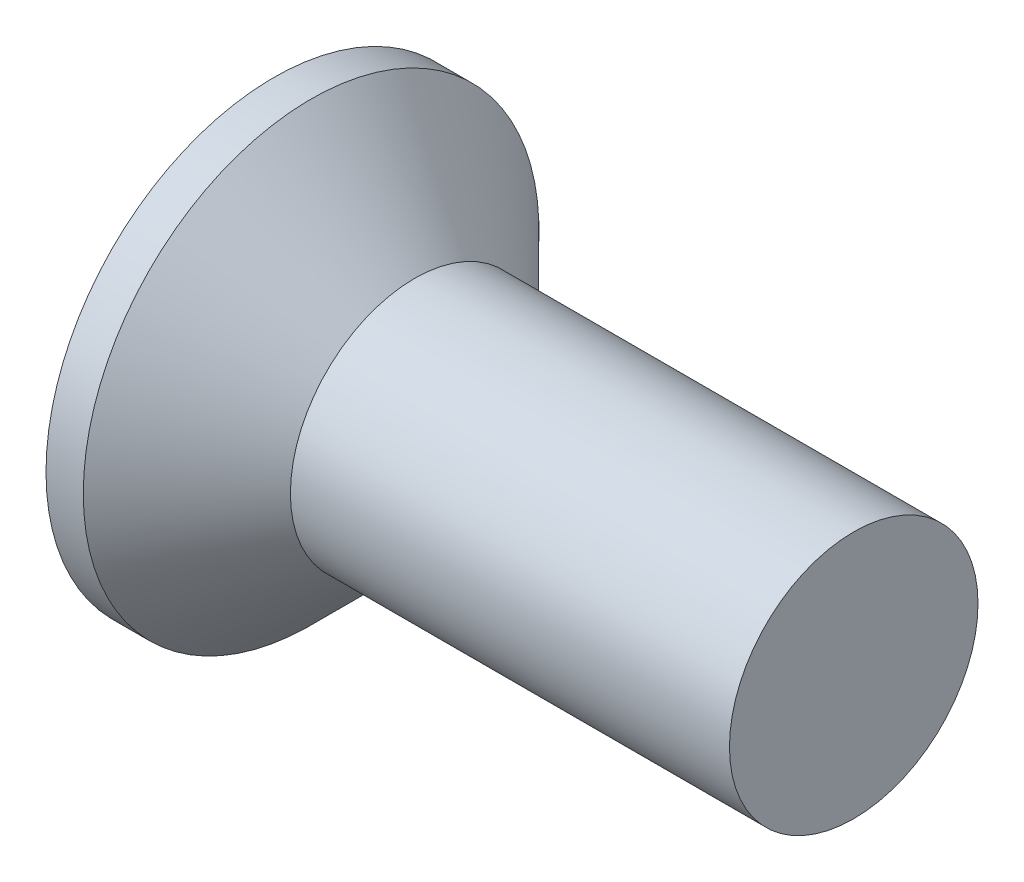
ISO-10303-21;
HEADER;
FILE_DESCRIPTION(('STEP AP214'),'2;1');
FILE_NAME('part.step','',(''),(''),'','','');
FILE_SCHEMA(('AUTOMOTIVE_DESIGN { 1 0 10303 214 1 1 1 1 }'));
ENDSEC;
DATA;
#1=APPLICATION_CONTEXT('core data for automotive mechanical design processes');
#2=APPLICATION_PROTOCOL_DEFINITION('international standard','automotive_design',2000,#1);
#3=PRODUCT_CONTEXT('',#1,'mechanical');
#4=PRODUCT('Part','Part','',(#3));
#5=PRODUCT_RELATED_PRODUCT_CATEGORY('part','',(#4));
#6=PRODUCT_DEFINITION_FORMATION('','',#4);
#7=PRODUCT_DEFINITION_CONTEXT('part definition',#1,'design');
#8=PRODUCT_DEFINITION('design','',#6,#7);
#9=PRODUCT_DEFINITION_SHAPE('','',#8);
#10=(LENGTH_UNIT() NAMED_UNIT(*) SI_UNIT(.MILLI.,.METRE.));
#11=(NAMED_UNIT(*) PLANE_ANGLE_UNIT() SI_UNIT($,.RADIAN.));
#12=(NAMED_UNIT(*) SI_UNIT($,.STERADIAN.) SOLID_ANGLE_UNIT());
#13=UNCERTAINTY_MEASURE_WITH_UNIT(LENGTH_MEASURE(1.E-05),#10,'distance_accuracy_value','');
#14=(GEOMETRIC_REPRESENTATION_CONTEXT(3) GLOBAL_UNCERTAINTY_ASSIGNED_CONTEXT((#13)) GLOBAL_UNIT_ASSIGNED_CONTEXT((#10,
#11,#12)) REPRESENTATION_CONTEXT('',''));
#15=CARTESIAN_POINT('',(0.,0.,0.));
#16=DIRECTION('',(0.,0.,1.));
#17=DIRECTION('',(1.,0.,0.));
#18=AXIS2_PLACEMENT_3D('',#15,#16,#17);
#19=CARTESIAN_POINT('',(0.,0.,0.));
#20=DIRECTION('',(-1.,0.,0.));
#21=DIRECTION('',(0.,0.,1.));
#22=AXIS2_PLACEMENT_3D('',#19,#20,#21);
#23=PLANE('',#22);
#24=CARTESIAN_POINT('',(0.,0.,0.));
#25=DIRECTION('',(-1.,0.,0.));
#26=DIRECTION('',(0.,0.,1.));
#27=AXIS2_PLACEMENT_3D('',#24,#25,#26);
#28=CIRCLE('',#27,2.75);
#29=CARTESIAN_POINT('',(0.,0.,2.75));
#30=VERTEX_POINT('',#29);
#31=EDGE_CURVE('E46',#30,#30,#28,.T.);
#32=ORIENTED_EDGE('',*,*,#31,.T.);
#33=EDGE_LOOP('',(#32));
#34=FACE_BOUND('',#33,.T.);
#35=DIRECTION('',(0.,1.,0.));
#36=VECTOR('',#35,1.);
#37=CARTESIAN_POINT('',(0.,-1.55,-0.395));
#38=LINE('',#37,#36);
#39=CARTESIAN_POINT('',(0.,-1.55,-0.395));
#40=VERTEX_POINT('',#39);
#41=CARTESIAN_POINT('',(0.,-0.394999999999999,-0.395));
#42=VERTEX_POINT('',#41);
#43=EDGE_CURVE('E107',#40,#42,#38,.T.);
#44=ORIENTED_EDGE('',*,*,#43,.T.);
#45=DIRECTION('',(0.,0.,-1.));
#46=VECTOR('',#45,1.);
#47=CARTESIAN_POINT('',(0.,-0.395000000000005,1.55));
#48=LINE('',#47,#46);
#49=CARTESIAN_POINT('',(0.,-0.394999999999994,-1.55));
#50=VERTEX_POINT('',#49);
#51=EDGE_CURVE('E87',#42,#50,#48,.T.);
#52=ORIENTED_EDGE('',*,*,#51,.T.);
#53=DIRECTION('',(0.,1.,0.));
#54=VECTOR('',#53,1.);
#55=CARTESIAN_POINT('',(0.,-0.394999999999994,-1.55));
#56=LINE('',#55,#54);
#57=CARTESIAN_POINT('',(0.,0.395000000000005,-1.55));
#58=VERTEX_POINT('',#57);
#59=EDGE_CURVE('E344',#50,#58,#56,.T.);
#60=ORIENTED_EDGE('',*,*,#59,.T.);
#61=DIRECTION('',(0.,0.,1.));
#62=VECTOR('',#61,1.);
#63=CARTESIAN_POINT('',(0.,0.395000000000005,-1.55));
#64=LINE('',#63,#62);
#65=CARTESIAN_POINT('',(0.,0.395000000000001,-0.395));
#66=VERTEX_POINT('',#65);
#67=EDGE_CURVE('E103',#58,#66,#64,.T.);
#68=ORIENTED_EDGE('',*,*,#67,.T.);
#69=CARTESIAN_POINT('',(0.,1.55,-0.395));
#70=VERTEX_POINT('',#69);
#71=EDGE_CURVE('E97',#66,#70,#38,.T.);
#72=ORIENTED_EDGE('',*,*,#71,.T.);
#73=DIRECTION('',(0.,0.,1.));
#74=VECTOR('',#73,1.);
#75=CARTESIAN_POINT('',(0.,1.55,-0.395));
#76=LINE('',#75,#74);
#77=CARTESIAN_POINT('',(0.,1.55,0.395));
#78=VERTEX_POINT('',#77);
#79=EDGE_CURVE('E100',#70,#78,#76,.T.);
#80=ORIENTED_EDGE('',*,*,#79,.T.);
#81=DIRECTION('',(0.,-1.,0.));
#82=VECTOR('',#81,1.);
#83=CARTESIAN_POINT('',(0.,1.55,0.395));
#84=LINE('',#83,#82);
#85=CARTESIAN_POINT('',(0.,0.394999999999998,0.395));
#86=VERTEX_POINT('',#85);
#87=EDGE_CURVE('E356',#78,#86,#84,.T.);
#88=ORIENTED_EDGE('',*,*,#87,.T.);
#89=CARTESIAN_POINT('',(0.,0.394999999999994,1.55));
#90=VERTEX_POINT('',#89);
#91=EDGE_CURVE('E339',#86,#90,#64,.T.);
#92=ORIENTED_EDGE('',*,*,#91,.T.);
#93=DIRECTION('',(0.,-1.,0.));
#94=VECTOR('',#93,1.);
#95=CARTESIAN_POINT('',(0.,0.394999999999994,1.55));
#96=LINE('',#95,#94);
#97=CARTESIAN_POINT('',(0.,-0.395000000000005,1.55));
#98=VERTEX_POINT('',#97);
#99=EDGE_CURVE('E325',#90,#98,#96,.T.);
#100=ORIENTED_EDGE('',*,*,#99,.T.);
#101=CARTESIAN_POINT('',(0.,-0.395000000000001,0.395));
#102=VERTEX_POINT('',#101);
#103=EDGE_CURVE('E337',#98,#102,#48,.T.);
#104=ORIENTED_EDGE('',*,*,#103,.T.);
#105=CARTESIAN_POINT('',(0.,-1.55,0.395));
#106=VERTEX_POINT('',#105);
#107=EDGE_CURVE('E113',#102,#106,#84,.T.);
#108=ORIENTED_EDGE('',*,*,#107,.T.);
#109=DIRECTION('',(0.,0.,-1.));
#110=VECTOR('',#109,1.);
#111=CARTESIAN_POINT('',(0.,-1.55,0.395));
#112=LINE('',#111,#110);
#113=EDGE_CURVE('E136',#106,#40,#112,.T.);
#114=ORIENTED_EDGE('',*,*,#113,.T.);
#115=EDGE_LOOP('',(#44,#52,#60,#68,#72,#80,#88,#92,#100,#104,#108,#114));
#116=FACE_BOUND('',#115,.T.);
#117=ADVANCED_FACE('F39',(#34,#116),#23,.T.);
#118=CARTESIAN_POINT('',(2.38373382624769,0.,0.168659889094269));
#119=DIRECTION('',(-0.0945267588569114,0.,-0.995522321125954));
#120=DIRECTION('',(-0.995522321125954,0.,0.0945267588569114));
#121=AXIS2_PLACEMENT_3D('',#118,#119,#120);
#122=PLANE('',#121);
#123=ORIENTED_EDGE('',*,*,#107,.F.);
#124=DIRECTION('',(0.991104257398676,0.0941072552097303,-0.09410725520973));
#125=VECTOR('',#124,1.);
#126=CARTESIAN_POINT('',(2.39946475118715,-0.167166207519493,0.167166207519491));
#127=LINE('',#126,#125);
#128=CARTESIAN_POINT('',(2.08,-0.197500000000003,0.1975));
#129=VERTEX_POINT('',#128);
#130=EDGE_CURVE('E131',#102,#129,#127,.T.);
#131=ORIENTED_EDGE('',*,*,#130,.T.);
#132=DIRECTION('',(0.835707904588478,0.543411029305728,-0.0793520726712617));
#133=VECTOR('',#132,1.);
#134=CARTESIAN_POINT('',(0.,-1.55,0.395));
#135=LINE('',#134,#133);
#136=EDGE_CURVE('E108',#106,#129,#135,.T.);
#137=ORIENTED_EDGE('',*,*,#136,.F.);
#138=EDGE_LOOP('',(#123,#131,#137));
#139=FACE_BOUND('',#138,.T.);
#140=ADVANCED_FACE('F159',(#139),#122,.T.);
#141=DIRECTION('',(0.835707904588477,-0.543411029305729,-0.0793520726712615));
#142=VECTOR('',#141,1.);
#143=CARTESIAN_POINT('',(0.,1.55,0.395));
#144=LINE('',#143,#142);
#145=CARTESIAN_POINT('',(2.08,0.197499999999997,0.1975));
#146=VERTEX_POINT('',#145);
#147=EDGE_CURVE('E53',#78,#146,#144,.T.);
#148=ORIENTED_EDGE('',*,*,#147,.T.);
#149=DIRECTION('',(-0.991104257398676,0.0941072552097295,0.0941072552097299));
#150=VECTOR('',#149,1.);
#151=CARTESIAN_POINT('',(2.39946475118715,0.167166207519486,0.167166207519491));
#152=LINE('',#151,#150);
#153=EDGE_CURVE('E352',#146,#86,#152,.T.);
#154=ORIENTED_EDGE('',*,*,#153,.T.);
#155=ORIENTED_EDGE('',*,*,#87,.F.);
#156=EDGE_LOOP('',(#148,#154,#155));
#157=FACE_BOUND('',#156,.T.);
#158=ADVANCED_FACE('F163',(#157),#122,.T.);
#159=CARTESIAN_POINT('',(2.38373382624769,0.,-0.168659889094269));
#160=DIRECTION('',(-0.0945267588569113,0.,0.995522321125954));
#161=DIRECTION('',(0.995522321125954,0.,0.0945267588569113));
#162=AXIS2_PLACEMENT_3D('',#159,#160,#161);
#163=PLANE('',#162);
#164=DIRECTION('',(0.835707904588478,0.543411029305728,0.0793520726712615));
#165=VECTOR('',#164,1.);
#166=CARTESIAN_POINT('',(0.,-1.55,-0.395));
#167=LINE('',#166,#165);
#168=CARTESIAN_POINT('',(2.08,-0.197500000000002,-0.1975));
#169=VERTEX_POINT('',#168);
#170=EDGE_CURVE('E62',#40,#169,#167,.T.);
#171=ORIENTED_EDGE('',*,*,#170,.T.);
#172=DIRECTION('',(-0.991104257398676,-0.0941072552097296,-0.0941072552097298));
#173=VECTOR('',#172,1.);
#174=CARTESIAN_POINT('',(2.39946475118715,-0.167166207519491,-0.167166207519488));
#175=LINE('',#174,#173);
#176=EDGE_CURVE('E11',#169,#42,#175,.T.);
#177=ORIENTED_EDGE('',*,*,#176,.T.);
#178=ORIENTED_EDGE('',*,*,#43,.F.);
#179=EDGE_LOOP('',(#171,#177,#178));
#180=FACE_BOUND('',#179,.T.);
#181=ADVANCED_FACE('F156',(#180),#163,.T.);
#182=ORIENTED_EDGE('',*,*,#71,.F.);
#183=DIRECTION('',(0.991104257398676,-0.0941072552097302,0.0941072552097298));
#184=VECTOR('',#183,1.);
#185=CARTESIAN_POINT('',(2.39946475118715,0.167166207519488,-0.167166207519488));
#186=LINE('',#185,#184);
#187=CARTESIAN_POINT('',(2.08,0.197499999999997,-0.1975));
#188=VERTEX_POINT('',#187);
#189=EDGE_CURVE('E116',#66,#188,#186,.T.);
#190=ORIENTED_EDGE('',*,*,#189,.T.);
#191=DIRECTION('',(0.835707904588477,-0.543411029305729,0.0793520726712615));
#192=VECTOR('',#191,1.);
#193=CARTESIAN_POINT('',(0.,1.55,-0.395));
#194=LINE('',#193,#192);
#195=EDGE_CURVE('E112',#70,#188,#194,.T.);
#196=ORIENTED_EDGE('',*,*,#195,.F.);
#197=EDGE_LOOP('',(#182,#190,#196));
#198=FACE_BOUND('',#197,.T.);
#199=ADVANCED_FACE('F115',(#198),#163,.T.);
#200=CARTESIAN_POINT('',(-6.34999999999999,0.,0.));
#201=DIRECTION('',(-1.,0.,0.));
#202=DIRECTION('',(0.,0.,1.));
#203=AXIS2_PLACEMENT_3D('',#200,#201,#202);
#204=CYLINDRICAL_SURFACE('',#203,2.75);
#205=CARTESIAN_POINT('',(0.450000000000005,0.,0.));
#206=DIRECTION('',(-1.,0.,0.));
#207=DIRECTION('',(0.,0.,1.));
#208=AXIS2_PLACEMENT_3D('',#205,#206,#207);
#209=CIRCLE('',#208,2.75);
#210=CARTESIAN_POINT('',(0.450000000000005,0.,2.75));
#211=VERTEX_POINT('',#210);
#212=EDGE_CURVE('E139',#211,#211,#209,.T.);
#213=ORIENTED_EDGE('',*,*,#212,.T.);
#214=EDGE_LOOP('',(#213));
#215=FACE_BOUND('',#214,.T.);
#216=ORIENTED_EDGE('',*,*,#31,.F.);
#217=EDGE_LOOP('',(#216));
#218=FACE_BOUND('',#217,.T.);
#219=ADVANCED_FACE('F145',(#215,#218),#204,.T.);
#220=CARTESIAN_POINT('',(0.450000000000005,0.,0.));
#221=DIRECTION('',(-1.,0.,0.));
#222=DIRECTION('',(0.,0.,1.));
#223=AXIS2_PLACEMENT_3D('',#220,#221,#222);
#224=CONICAL_SURFACE('',#223,2.75,0.78539816339745);
#225=CARTESIAN_POINT('',(1.7,0.,0.));
#226=DIRECTION('',(-1.,0.,0.));
#227=DIRECTION('',(0.,0.,1.));
#228=AXIS2_PLACEMENT_3D('',#225,#226,#227);
#229=CIRCLE('',#228,1.5);
#230=CARTESIAN_POINT('',(1.7,0.,1.5));
#231=VERTEX_POINT('',#230);
#232=EDGE_CURVE('E135',#231,#231,#229,.T.);
#233=ORIENTED_EDGE('',*,*,#232,.T.);
#234=EDGE_LOOP('',(#233));
#235=FACE_BOUND('',#234,.T.);
#236=ORIENTED_EDGE('',*,*,#212,.F.);
#237=EDGE_LOOP('',(#236));
#238=FACE_BOUND('',#237,.T.);
#239=ADVANCED_FACE('F147',(#235,#238),#224,.T.);
#240=CARTESIAN_POINT('',(-6.34999999999999,0.,0.));
#241=DIRECTION('',(-1.,0.,0.));
#242=DIRECTION('',(0.,0.,1.));
#243=AXIS2_PLACEMENT_3D('',#240,#241,#242);
#244=CYLINDRICAL_SURFACE('',#243,1.5);
#245=CARTESIAN_POINT('',(7.,0.,0.));
#246=DIRECTION('',(-1.,0.,0.));
#247=DIRECTION('',(0.,0.,1.));
#248=AXIS2_PLACEMENT_3D('',#245,#246,#247);
#249=CIRCLE('',#248,1.5);
#250=CARTESIAN_POINT('',(7.,0.,1.5));
#251=VERTEX_POINT('',#250);
#252=EDGE_CURVE('E132',#251,#251,#249,.T.);
#253=ORIENTED_EDGE('',*,*,#252,.T.);
#254=EDGE_LOOP('',(#253));
#255=FACE_BOUND('',#254,.T.);
#256=ORIENTED_EDGE('',*,*,#232,.F.);
#257=EDGE_LOOP('',(#256));
#258=FACE_BOUND('',#257,.T.);
#259=ADVANCED_FACE('F153',(#255,#258),#244,.T.);
#260=CARTESIAN_POINT('',(7.,1.5,0.));
#261=DIRECTION('',(1.,0.,0.));
#262=DIRECTION('',(0.,0.,-1.));
#263=AXIS2_PLACEMENT_3D('',#260,#261,#262);
#264=PLANE('',#263);
#265=ORIENTED_EDGE('',*,*,#252,.F.);
#266=EDGE_LOOP('',(#265));
#267=FACE_BOUND('',#266,.T.);
#268=ADVANCED_FACE('F183',(#267),#264,.T.);
#269=CARTESIAN_POINT('',(2.08,0.197499999999997,-0.1975));
#270=DIRECTION('',(1.,0.,0.));
#271=DIRECTION('',(0.,0.,-1.));
#272=AXIS2_PLACEMENT_3D('',#269,#270,#271);
#273=PLANE('',#272);
#274=DIRECTION('',(0.,1.,0.));
#275=VECTOR('',#274,1.);
#276=CARTESIAN_POINT('',(2.08,-0.197500000000002,-0.1975));
#277=LINE('',#276,#275);
#278=EDGE_CURVE('E127',#169,#188,#277,.T.);
#279=ORIENTED_EDGE('',*,*,#278,.F.);
#280=DIRECTION('',(0.,0.,-1.));
#281=VECTOR('',#280,1.);
#282=CARTESIAN_POINT('',(2.08,-0.197500000000002,0.1975));
#283=LINE('',#282,#281);
#284=EDGE_CURVE('E118',#129,#169,#283,.T.);
#285=ORIENTED_EDGE('',*,*,#284,.F.);
#286=DIRECTION('',(0.,-1.,0.));
#287=VECTOR('',#286,1.);
#288=CARTESIAN_POINT('',(2.08,0.197499999999997,0.1975));
#289=LINE('',#288,#287);
#290=EDGE_CURVE('E121',#146,#129,#289,.T.);
#291=ORIENTED_EDGE('',*,*,#290,.F.);
#292=DIRECTION('',(0.,0.,1.));
#293=VECTOR('',#292,1.);
#294=CARTESIAN_POINT('',(2.08,0.197499999999997,-0.1975));
#295=LINE('',#294,#293);
#296=EDGE_CURVE('E125',#188,#146,#295,.T.);
#297=ORIENTED_EDGE('',*,*,#296,.F.);
#298=EDGE_LOOP('',(#279,#285,#291,#297));
#299=FACE_BOUND('',#298,.T.);
#300=ADVANCED_FACE('F180',(#299),#273,.F.);
#301=CARTESIAN_POINT('',(0.,-1.55,-0.395));
#302=DIRECTION('',(-0.54513001368185,0.838351518268576,0.));
#303=DIRECTION('',(-0.838351518268576,-0.54513001368185,0.));
#304=AXIS2_PLACEMENT_3D('',#301,#302,#303);
#305=PLANE('',#304);
#306=ORIENTED_EDGE('',*,*,#170,.F.);
#307=ORIENTED_EDGE('',*,*,#113,.F.);
#308=ORIENTED_EDGE('',*,*,#136,.T.);
#309=ORIENTED_EDGE('',*,*,#284,.T.);
#310=EDGE_LOOP('',(#306,#307,#308,#309));
#311=FACE_BOUND('',#310,.T.);
#312=ADVANCED_FACE('F172',(#311),#305,.T.);
#313=CARTESIAN_POINT('',(2.08,0.197499999999997,0.1975));
#314=DIRECTION('',(-0.54513001368185,-0.838351518268575,0.));
#315=DIRECTION('',(0.838351518268576,-0.54513001368185,0.));
#316=AXIS2_PLACEMENT_3D('',#313,#314,#315);
#317=PLANE('',#316);
#318=ORIENTED_EDGE('',*,*,#147,.F.);
#319=ORIENTED_EDGE('',*,*,#79,.F.);
#320=ORIENTED_EDGE('',*,*,#195,.T.);
#321=ORIENTED_EDGE('',*,*,#296,.T.);
#322=EDGE_LOOP('',(#318,#319,#320,#321));
#323=FACE_BOUND('',#322,.T.);
#324=ADVANCED_FACE('F111',(#323),#317,.T.);
#325=CARTESIAN_POINT('',(2.38373382624769,-0.168659889094273,0.));
#326=DIRECTION('',(-0.0945267588569114,0.995522321125954,0.));
#327=DIRECTION('',(-0.995522321125954,-0.0945267588569114,0.));
#328=AXIS2_PLACEMENT_3D('',#325,#326,#327);
#329=PLANE('',#328);
#330=DIRECTION('',(0.835707904588478,0.0793520726712598,0.543411029305728));
#331=VECTOR('',#330,1.);
#332=CARTESIAN_POINT('',(0.,-0.394999999999994,-1.55));
#333=LINE('',#332,#331);
#334=EDGE_CURVE('E346',#50,#169,#333,.T.);
#335=ORIENTED_EDGE('',*,*,#334,.F.);
#336=ORIENTED_EDGE('',*,*,#51,.F.);
#337=ORIENTED_EDGE('',*,*,#176,.F.);
#338=EDGE_LOOP('',(#335,#336,#337));
#339=FACE_BOUND('',#338,.T.);
#340=ADVANCED_FACE('F179',(#339),#329,.T.);
#341=CARTESIAN_POINT('',(2.38373382624769,0.168659889094268,0.));
#342=DIRECTION('',(-0.0945267588569113,-0.995522321125954,0.));
#343=DIRECTION('',(0.995522321125954,-0.0945267588569113,0.));
#344=AXIS2_PLACEMENT_3D('',#341,#342,#343);
#345=PLANE('',#344);
#346=ORIENTED_EDGE('',*,*,#67,.F.);
#347=DIRECTION('',(0.835707904588478,-0.0793520726712634,0.543411029305728));
#348=VECTOR('',#347,1.);
#349=CARTESIAN_POINT('',(0.,0.395000000000005,-1.55));
#350=LINE('',#349,#348);
#351=EDGE_CURVE('E78',#58,#188,#350,.T.);
#352=ORIENTED_EDGE('',*,*,#351,.T.);
#353=ORIENTED_EDGE('',*,*,#189,.F.);
#354=EDGE_LOOP('',(#346,#352,#353));
#355=FACE_BOUND('',#354,.T.);
#356=ADVANCED_FACE('F222',(#355),#345,.T.);
#357=CARTESIAN_POINT('',(0.,0.395000000000005,-1.55));
#358=DIRECTION('',(-0.54513001368185,0.,0.838351518268576));
#359=DIRECTION('',(-0.838351518268576,0.,-0.54513001368185));
#360=AXIS2_PLACEMENT_3D('',#357,#358,#359);
#361=PLANE('',#360);
#362=ORIENTED_EDGE('',*,*,#351,.F.);
#363=ORIENTED_EDGE('',*,*,#59,.F.);
#364=ORIENTED_EDGE('',*,*,#334,.T.);
#365=ORIENTED_EDGE('',*,*,#278,.T.);
#366=EDGE_LOOP('',(#362,#363,#364,#365));
#367=FACE_BOUND('',#366,.T.);
#368=ADVANCED_FACE('F230',(#367),#361,.T.);
#369=ORIENTED_EDGE('',*,*,#103,.F.);
#370=DIRECTION('',(0.835707904588477,0.0793520726712634,-0.543411029305728));
#371=VECTOR('',#370,1.);
#372=CARTESIAN_POINT('',(0.,-0.395000000000005,1.55));
#373=LINE('',#372,#371);
#374=EDGE_CURVE('E322',#98,#129,#373,.T.);
#375=ORIENTED_EDGE('',*,*,#374,.T.);
#376=ORIENTED_EDGE('',*,*,#130,.F.);
#377=EDGE_LOOP('',(#369,#375,#376));
#378=FACE_BOUND('',#377,.T.);
#379=ADVANCED_FACE('F224',(#378),#329,.T.);
#380=DIRECTION('',(0.835707904588477,-0.0793520726712596,-0.543411029305729));
#381=VECTOR('',#380,1.);
#382=CARTESIAN_POINT('',(0.,0.394999999999994,1.55));
#383=LINE('',#382,#381);
#384=EDGE_CURVE('E333',#90,#146,#383,.T.);
#385=ORIENTED_EDGE('',*,*,#384,.F.);
#386=ORIENTED_EDGE('',*,*,#91,.F.);
#387=ORIENTED_EDGE('',*,*,#153,.F.);
#388=EDGE_LOOP('',(#385,#386,#387));
#389=FACE_BOUND('',#388,.T.);
#390=ADVANCED_FACE('F232',(#389),#345,.T.);
#391=CARTESIAN_POINT('',(2.08,-0.197500000000003,0.1975));
#392=DIRECTION('',(-0.54513001368185,0.,-0.838351518268575));
#393=DIRECTION('',(0.838351518268576,0.,-0.54513001368185));
#394=AXIS2_PLACEMENT_3D('',#391,#392,#393);
#395=PLANE('',#394);
#396=ORIENTED_EDGE('',*,*,#374,.F.);
#397=ORIENTED_EDGE('',*,*,#99,.F.);
#398=ORIENTED_EDGE('',*,*,#384,.T.);
#399=ORIENTED_EDGE('',*,*,#290,.T.);
#400=EDGE_LOOP('',(#396,#397,#398,#399));
#401=FACE_BOUND('',#400,.T.);
#402=ADVANCED_FACE('F251',(#401),#395,.T.);
#403=CLOSED_SHELL('',(#117,#140,#158,#181,#199,#219,#239,#259,#268,#300,#312,#324,#340,#356,
#368,#379,#390,#402));
#404=MANIFOLD_SOLID_BREP('B2',#403);
#405=ADVANCED_BREP_SHAPE_REPRESENTATION('',(#18,#404),#14);
#406=SHAPE_DEFINITION_REPRESENTATION(#9,#405);
ENDSEC;
END-ISO-10303-21;
